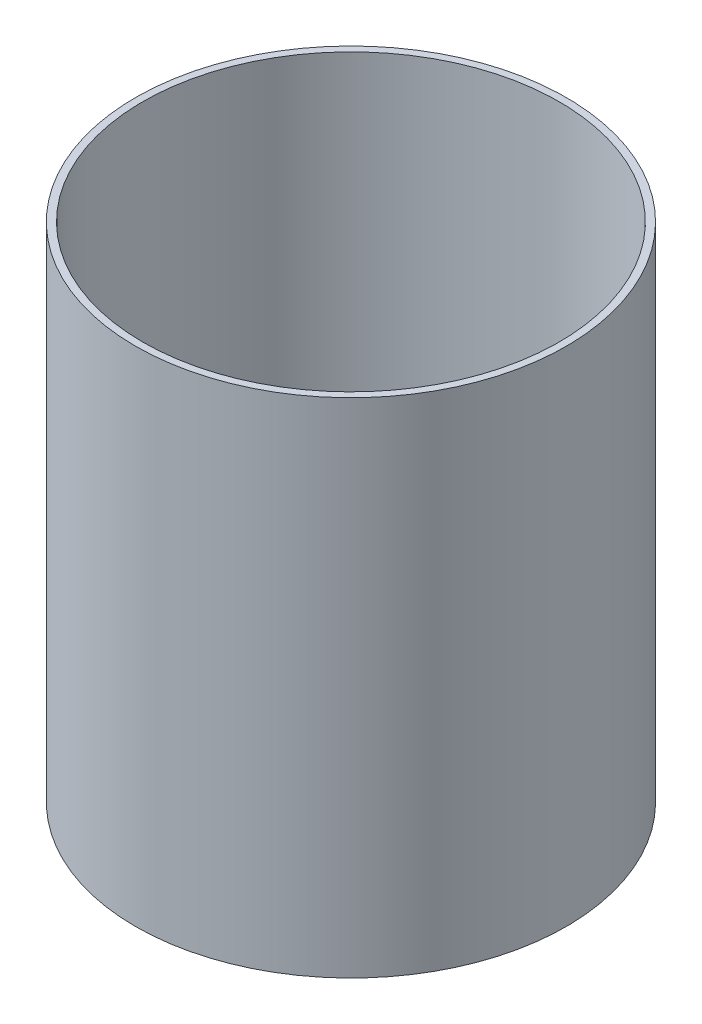
ISO-10303-21;
HEADER;
FILE_DESCRIPTION(('STEP AP214'),'2;1');
FILE_NAME('part.step','',(''),(''),'','','');
FILE_SCHEMA(('AUTOMOTIVE_DESIGN { 1 0 10303 214 1 1 1 1 }'));
ENDSEC;
DATA;
#1=APPLICATION_CONTEXT('core data for automotive mechanical design processes');
#2=APPLICATION_PROTOCOL_DEFINITION('international standard','automotive_design',2000,#1);
#3=PRODUCT_CONTEXT('',#1,'mechanical');
#4=PRODUCT('Part','Part','',(#3));
#5=PRODUCT_RELATED_PRODUCT_CATEGORY('part','',(#4));
#6=PRODUCT_DEFINITION_FORMATION('','',#4);
#7=PRODUCT_DEFINITION_CONTEXT('part definition',#1,'design');
#8=PRODUCT_DEFINITION('design','',#6,#7);
#9=PRODUCT_DEFINITION_SHAPE('','',#8);
#10=(LENGTH_UNIT() NAMED_UNIT(*) SI_UNIT(.MILLI.,.METRE.));
#11=(NAMED_UNIT(*) PLANE_ANGLE_UNIT() SI_UNIT($,.RADIAN.));
#12=(NAMED_UNIT(*) SI_UNIT($,.STERADIAN.) SOLID_ANGLE_UNIT());
#13=UNCERTAINTY_MEASURE_WITH_UNIT(LENGTH_MEASURE(1.E-05),#10,'distance_accuracy_value','');
#14=(GEOMETRIC_REPRESENTATION_CONTEXT(3) GLOBAL_UNCERTAINTY_ASSIGNED_CONTEXT((#13)) GLOBAL_UNIT_ASSIGNED_CONTEXT((#10,
#11,#12)) REPRESENTATION_CONTEXT('',''));
#15=CARTESIAN_POINT('',(0.,0.,0.));
#16=DIRECTION('',(0.,0.,1.));
#17=DIRECTION('',(1.,0.,0.));
#18=AXIS2_PLACEMENT_3D('',#15,#16,#17);
#19=CARTESIAN_POINT('',(0.,88.9,0.));
#20=DIRECTION('',(0.,1.,0.));
#21=DIRECTION('',(0.,0.,1.));
#22=AXIS2_PLACEMENT_3D('',#19,#20,#21);
#23=PLANE('',#22);
#24=CARTESIAN_POINT('',(0.,88.9,0.));
#25=DIRECTION('',(0.,1.,0.));
#26=DIRECTION('',(0.,0.,1.));
#27=AXIS2_PLACEMENT_3D('',#24,#25,#26);
#28=CIRCLE('',#27,38.1);
#29=CARTESIAN_POINT('',(0.,88.9,38.1));
#30=VERTEX_POINT('',#29);
#31=EDGE_CURVE('E10',#30,#30,#28,.T.);
#32=ORIENTED_EDGE('',*,*,#31,.T.);
#33=EDGE_LOOP('',(#32));
#34=FACE_BOUND('',#33,.T.);
#35=CARTESIAN_POINT('',(0.,88.9,0.));
#36=DIRECTION('',(0.,1.,0.));
#37=DIRECTION('',(0.,0.,1.));
#38=AXIS2_PLACEMENT_3D('',#35,#36,#37);
#39=CIRCLE('',#38,36.83);
#40=CARTESIAN_POINT('',(0.,88.9,36.83));
#41=VERTEX_POINT('',#40);
#42=EDGE_CURVE('E54',#41,#41,#39,.T.);
#43=ORIENTED_EDGE('',*,*,#42,.F.);
#44=EDGE_LOOP('',(#43));
#45=FACE_BOUND('',#44,.T.);
#46=ADVANCED_FACE('F41',(#34,#45),#23,.T.);
#47=CARTESIAN_POINT('',(0.,0.,0.));
#48=DIRECTION('',(0.,1.,0.));
#49=DIRECTION('',(0.,0.,1.));
#50=AXIS2_PLACEMENT_3D('',#47,#48,#49);
#51=PLANE('',#50);
#52=CARTESIAN_POINT('',(0.,0.,0.));
#53=DIRECTION('',(0.,1.,0.));
#54=DIRECTION('',(0.,0.,1.));
#55=AXIS2_PLACEMENT_3D('',#52,#53,#54);
#56=CIRCLE('',#55,38.1);
#57=CARTESIAN_POINT('',(0.,0.,38.1));
#58=VERTEX_POINT('',#57);
#59=EDGE_CURVE('E45',#58,#58,#56,.T.);
#60=ORIENTED_EDGE('',*,*,#59,.F.);
#61=EDGE_LOOP('',(#60));
#62=FACE_BOUND('',#61,.T.);
#63=CARTESIAN_POINT('',(0.,0.,0.));
#64=DIRECTION('',(0.,1.,0.));
#65=DIRECTION('',(0.,0.,1.));
#66=AXIS2_PLACEMENT_3D('',#63,#64,#65);
#67=CIRCLE('',#66,36.83);
#68=CARTESIAN_POINT('',(0.,0.,36.83));
#69=VERTEX_POINT('',#68);
#70=EDGE_CURVE('E56',#69,#69,#67,.T.);
#71=ORIENTED_EDGE('',*,*,#70,.T.);
#72=EDGE_LOOP('',(#71));
#73=FACE_BOUND('',#72,.T.);
#74=ADVANCED_FACE('F68',(#62,#73),#51,.F.);
#75=CARTESIAN_POINT('',(0.,88.9,0.));
#76=DIRECTION('',(0.,-1.,0.));
#77=DIRECTION('',(0.,0.,-1.));
#78=AXIS2_PLACEMENT_3D('',#75,#76,#77);
#79=CYLINDRICAL_SURFACE('',#78,38.1);
#80=ORIENTED_EDGE('',*,*,#31,.F.);
#81=EDGE_LOOP('',(#80));
#82=FACE_BOUND('',#81,.T.);
#83=ORIENTED_EDGE('',*,*,#59,.T.);
#84=EDGE_LOOP('',(#83));
#85=FACE_BOUND('',#84,.T.);
#86=ADVANCED_FACE('F43',(#82,#85),#79,.T.);
#87=CARTESIAN_POINT('',(0.,88.9,0.));
#88=DIRECTION('',(0.,-1.,0.));
#89=DIRECTION('',(0.,0.,-1.));
#90=AXIS2_PLACEMENT_3D('',#87,#88,#89);
#91=CYLINDRICAL_SURFACE('',#90,36.83);
#92=ORIENTED_EDGE('',*,*,#42,.T.);
#93=EDGE_LOOP('',(#92));
#94=FACE_BOUND('',#93,.T.);
#95=ORIENTED_EDGE('',*,*,#70,.F.);
#96=EDGE_LOOP('',(#95));
#97=FACE_BOUND('',#96,.T.);
#98=ADVANCED_FACE('F64',(#94,#97),#91,.F.);
#99=CLOSED_SHELL('',(#46,#74,#86,#98));
#100=MANIFOLD_SOLID_BREP('B2',#99);
#101=ADVANCED_BREP_SHAPE_REPRESENTATION('',(#18,#100),#14);
#102=SHAPE_DEFINITION_REPRESENTATION(#9,#101);
ENDSEC;
END-ISO-10303-21;
